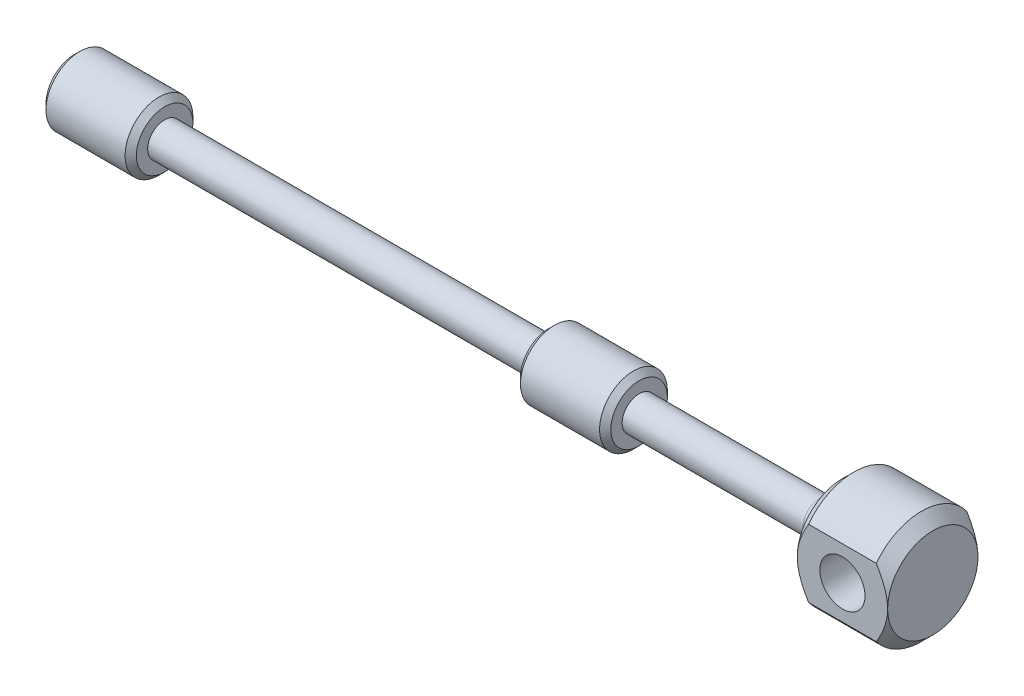
ISO-10303-21;
HEADER;
FILE_DESCRIPTION(('STEP AP214'),'2;1');
FILE_NAME('part.step','',(''),(''),'','','');
FILE_SCHEMA(('AUTOMOTIVE_DESIGN { 1 0 10303 214 1 1 1 1 }'));
ENDSEC;
DATA;
#1=APPLICATION_CONTEXT('core data for automotive mechanical design processes');
#2=APPLICATION_PROTOCOL_DEFINITION('international standard','automotive_design',2000,#1);
#3=PRODUCT_CONTEXT('',#1,'mechanical');
#4=PRODUCT('Part','Part','',(#3));
#5=PRODUCT_RELATED_PRODUCT_CATEGORY('part','',(#4));
#6=PRODUCT_DEFINITION_FORMATION('','',#4);
#7=PRODUCT_DEFINITION_CONTEXT('part definition',#1,'design');
#8=PRODUCT_DEFINITION('design','',#6,#7);
#9=PRODUCT_DEFINITION_SHAPE('','',#8);
#10=(LENGTH_UNIT() NAMED_UNIT(*) SI_UNIT(.MILLI.,.METRE.));
#11=(NAMED_UNIT(*) PLANE_ANGLE_UNIT() SI_UNIT($,.RADIAN.));
#12=(NAMED_UNIT(*) SI_UNIT($,.STERADIAN.) SOLID_ANGLE_UNIT());
#13=UNCERTAINTY_MEASURE_WITH_UNIT(LENGTH_MEASURE(1.E-05),#10,'distance_accuracy_value','');
#14=(GEOMETRIC_REPRESENTATION_CONTEXT(3) GLOBAL_UNCERTAINTY_ASSIGNED_CONTEXT((#13)) GLOBAL_UNIT_ASSIGNED_CONTEXT((#10,
#11,#12)) REPRESENTATION_CONTEXT('',''));
#15=CARTESIAN_POINT('',(0.,0.,0.));
#16=DIRECTION('',(0.,0.,1.));
#17=DIRECTION('',(1.,0.,0.));
#18=AXIS2_PLACEMENT_3D('',#15,#16,#17);
#19=CARTESIAN_POINT('',(30.,0.,0.));
#20=DIRECTION('',(1.,0.,0.));
#21=DIRECTION('',(0.,0.,-1.));
#22=AXIS2_PLACEMENT_3D('',#19,#20,#21);
#23=CYLINDRICAL_SURFACE('',#22,5.);
#24=DIRECTION('',(1.,0.,0.));
#25=VECTOR('',#24,1.);
#26=CARTESIAN_POINT('',(30.,3.,-4.));
#27=LINE('',#26,#25);
#28=CARTESIAN_POINT('',(31.,3.,-4.));
#29=VERTEX_POINT('',#28);
#30=CARTESIAN_POINT('',(37.,3.,-4.));
#31=VERTEX_POINT('',#30);
#32=EDGE_CURVE('E352',#29,#31,#27,.T.);
#33=ORIENTED_EDGE('',*,*,#32,.F.);
#34=CARTESIAN_POINT('',(31.,0.,0.));
#35=DIRECTION('',(1.,0.,0.));
#36=DIRECTION('',(0.,0.,-1.));
#37=AXIS2_PLACEMENT_3D('',#34,#35,#36);
#38=CIRCLE('',#37,5.);
#39=CARTESIAN_POINT('',(31.,3.,4.));
#40=VERTEX_POINT('',#39);
#41=EDGE_CURVE('E200',#29,#40,#38,.T.);
#42=ORIENTED_EDGE('',*,*,#41,.T.);
#43=DIRECTION('',(1.,0.,0.));
#44=VECTOR('',#43,1.);
#45=CARTESIAN_POINT('',(30.,3.,4.));
#46=LINE('',#45,#44);
#47=CARTESIAN_POINT('',(37.,3.,4.));
#48=VERTEX_POINT('',#47);
#49=EDGE_CURVE('E115',#40,#48,#46,.T.);
#50=ORIENTED_EDGE('',*,*,#49,.T.);
#51=CARTESIAN_POINT('',(37.,0.,0.));
#52=DIRECTION('',(1.,0.,0.));
#53=DIRECTION('',(0.,0.,-1.));
#54=AXIS2_PLACEMENT_3D('',#51,#52,#53);
#55=CIRCLE('',#54,5.);
#56=EDGE_CURVE('E104',#48,#31,#55,.F.);
#57=ORIENTED_EDGE('',*,*,#56,.T.);
#58=EDGE_LOOP('',(#33,#42,#50,#57));
#59=FACE_BOUND('',#58,.T.);
#60=ADVANCED_FACE('F39',(#59),#23,.T.);
#61=CARTESIAN_POINT('',(38.,0.,0.));
#62=DIRECTION('',(-1.,0.,0.));
#63=DIRECTION('',(0.,0.,1.));
#64=AXIS2_PLACEMENT_3D('',#61,#62,#63);
#65=CYLINDRICAL_SURFACE('',#64,1.5);
#66=CARTESIAN_POINT('',(28.,0.,0.));
#67=DIRECTION('',(1.,0.,0.));
#68=DIRECTION('',(0.,0.,-1.));
#69=AXIS2_PLACEMENT_3D('',#66,#67,#68);
#70=CIRCLE('',#69,1.5);
#71=CARTESIAN_POINT('',(28.,0.,-1.5));
#72=VERTEX_POINT('',#71);
#73=EDGE_CURVE('E11',#72,#72,#70,.F.);
#74=ORIENTED_EDGE('',*,*,#73,.T.);
#75=EDGE_LOOP('',(#74));
#76=FACE_BOUND('',#75,.T.);
#77=CARTESIAN_POINT('',(12.,0.,0.));
#78=DIRECTION('',(-1.,0.,0.));
#79=DIRECTION('',(0.,0.,1.));
#80=AXIS2_PLACEMENT_3D('',#77,#78,#79);
#81=CIRCLE('',#80,1.5);
#82=CARTESIAN_POINT('',(12.,0.,1.5));
#83=VERTEX_POINT('',#82);
#84=EDGE_CURVE('E300',#83,#83,#81,.T.);
#85=ORIENTED_EDGE('',*,*,#84,.F.);
#86=EDGE_LOOP('',(#85));
#87=FACE_BOUND('',#86,.T.);
#88=ADVANCED_FACE('F224',(#76,#87),#65,.T.);
#89=CARTESIAN_POINT('',(4.,0.,0.));
#90=DIRECTION('',(-1.,0.,0.));
#91=DIRECTION('',(0.,0.,1.));
#92=AXIS2_PLACEMENT_3D('',#89,#90,#91);
#93=CIRCLE('',#92,1.5);
#94=CARTESIAN_POINT('',(4.,0.,1.5));
#95=VERTEX_POINT('',#94);
#96=EDGE_CURVE('E293',#95,#95,#93,.T.);
#97=ORIENTED_EDGE('',*,*,#96,.T.);
#98=EDGE_LOOP('',(#97));
#99=FACE_BOUND('',#98,.T.);
#100=CARTESIAN_POINT('',(-30.,0.,0.));
#101=DIRECTION('',(-1.,0.,0.));
#102=DIRECTION('',(0.,0.,1.));
#103=AXIS2_PLACEMENT_3D('',#100,#101,#102);
#104=CIRCLE('',#103,1.5);
#105=CARTESIAN_POINT('',(-30.,0.,1.5));
#106=VERTEX_POINT('',#105);
#107=EDGE_CURVE('E295',#106,#106,#104,.T.);
#108=ORIENTED_EDGE('',*,*,#107,.F.);
#109=EDGE_LOOP('',(#108));
#110=FACE_BOUND('',#109,.T.);
#111=ADVANCED_FACE('F229',(#99,#110),#65,.T.);
#112=CARTESIAN_POINT('',(-30.,0.,0.));
#113=DIRECTION('',(-1.,0.,0.));
#114=DIRECTION('',(0.,0.,1.));
#115=AXIS2_PLACEMENT_3D('',#112,#113,#114);
#116=CYLINDRICAL_SURFACE('',#115,3.);
#117=CARTESIAN_POINT('',(-37.5,0.,0.));
#118=DIRECTION('',(1.,0.,0.));
#119=DIRECTION('',(0.,0.,-1.));
#120=AXIS2_PLACEMENT_3D('',#117,#118,#119);
#121=CIRCLE('',#120,3.);
#122=CARTESIAN_POINT('',(-37.5,0.,-3.));
#123=VERTEX_POINT('',#122);
#124=EDGE_CURVE('E327',#123,#123,#121,.T.);
#125=ORIENTED_EDGE('',*,*,#124,.T.);
#126=EDGE_LOOP('',(#125));
#127=FACE_BOUND('',#126,.T.);
#128=CARTESIAN_POINT('',(-30.5,0.,0.));
#129=DIRECTION('',(-1.,0.,0.));
#130=DIRECTION('',(0.,0.,1.));
#131=AXIS2_PLACEMENT_3D('',#128,#129,#130);
#132=CIRCLE('',#131,3.);
#133=CARTESIAN_POINT('',(-30.5,0.,3.));
#134=VERTEX_POINT('',#133);
#135=EDGE_CURVE('E323',#134,#134,#132,.T.);
#136=ORIENTED_EDGE('',*,*,#135,.T.);
#137=EDGE_LOOP('',(#136));
#138=FACE_BOUND('',#137,.T.);
#139=ADVANCED_FACE('F260',(#127,#138),#116,.T.);
#140=CARTESIAN_POINT('',(-30.,0.,0.));
#141=DIRECTION('',(-1.,0.,0.));
#142=DIRECTION('',(0.,0.,1.));
#143=AXIS2_PLACEMENT_3D('',#140,#141,#142);
#144=PLANE('',#143);
#145=CARTESIAN_POINT('',(-30.,0.,0.));
#146=DIRECTION('',(-1.,0.,0.));
#147=DIRECTION('',(0.,0.,1.));
#148=AXIS2_PLACEMENT_3D('',#145,#146,#147);
#149=CIRCLE('',#148,2.5);
#150=CARTESIAN_POINT('',(-30.,0.,2.5));
#151=VERTEX_POINT('',#150);
#152=EDGE_CURVE('E128',#151,#151,#149,.F.);
#153=ORIENTED_EDGE('',*,*,#152,.T.);
#154=EDGE_LOOP('',(#153));
#155=FACE_BOUND('',#154,.T.);
#156=ORIENTED_EDGE('',*,*,#107,.T.);
#157=EDGE_LOOP('',(#156));
#158=FACE_BOUND('',#157,.T.);
#159=ADVANCED_FACE('F266',(#155,#158),#144,.F.);
#160=CARTESIAN_POINT('',(-38.,0.,0.));
#161=DIRECTION('',(1.,0.,0.));
#162=DIRECTION('',(0.,0.,-1.));
#163=AXIS2_PLACEMENT_3D('',#160,#161,#162);
#164=PLANE('',#163);
#165=CARTESIAN_POINT('',(-38.,0.,0.));
#166=DIRECTION('',(1.,0.,0.));
#167=DIRECTION('',(0.,0.,-1.));
#168=AXIS2_PLACEMENT_3D('',#165,#166,#167);
#169=CIRCLE('',#168,2.5);
#170=CARTESIAN_POINT('',(-38.,0.,-2.5));
#171=VERTEX_POINT('',#170);
#172=EDGE_CURVE('E319',#171,#171,#169,.F.);
#173=ORIENTED_EDGE('',*,*,#172,.T.);
#174=EDGE_LOOP('',(#173));
#175=FACE_BOUND('',#174,.T.);
#176=ADVANCED_FACE('F262',(#175),#164,.F.);
#177=CARTESIAN_POINT('',(4.,0.,0.));
#178=DIRECTION('',(1.,0.,0.));
#179=DIRECTION('',(0.,0.,-1.));
#180=AXIS2_PLACEMENT_3D('',#177,#178,#179);
#181=CYLINDRICAL_SURFACE('',#180,3.);
#182=CARTESIAN_POINT('',(11.5,0.,0.));
#183=DIRECTION('',(-1.,0.,0.));
#184=DIRECTION('',(0.,0.,1.));
#185=AXIS2_PLACEMENT_3D('',#182,#183,#184);
#186=CIRCLE('',#185,3.);
#187=CARTESIAN_POINT('',(11.5,0.,3.));
#188=VERTEX_POINT('',#187);
#189=EDGE_CURVE('E309',#188,#188,#186,.T.);
#190=ORIENTED_EDGE('',*,*,#189,.T.);
#191=EDGE_LOOP('',(#190));
#192=FACE_BOUND('',#191,.T.);
#193=CARTESIAN_POINT('',(4.50000000000001,0.,0.));
#194=DIRECTION('',(-1.,0.,0.));
#195=DIRECTION('',(0.,0.,1.));
#196=AXIS2_PLACEMENT_3D('',#193,#194,#195);
#197=CIRCLE('',#196,3.);
#198=CARTESIAN_POINT('',(4.50000000000001,0.,3.));
#199=VERTEX_POINT('',#198);
#200=EDGE_CURVE('E305',#199,#199,#197,.F.);
#201=ORIENTED_EDGE('',*,*,#200,.T.);
#202=EDGE_LOOP('',(#201));
#203=FACE_BOUND('',#202,.T.);
#204=ADVANCED_FACE('F265',(#192,#203),#181,.T.);
#205=CARTESIAN_POINT('',(4.,0.,0.));
#206=DIRECTION('',(-1.,0.,0.));
#207=DIRECTION('',(0.,0.,1.));
#208=AXIS2_PLACEMENT_3D('',#205,#206,#207);
#209=PLANE('',#208);
#210=CARTESIAN_POINT('',(4.,0.,0.));
#211=DIRECTION('',(-1.,0.,0.));
#212=DIRECTION('',(0.,0.,1.));
#213=AXIS2_PLACEMENT_3D('',#210,#211,#212);
#214=CIRCLE('',#213,2.5);
#215=CARTESIAN_POINT('',(4.,0.,2.5));
#216=VERTEX_POINT('',#215);
#217=EDGE_CURVE('E290',#216,#216,#214,.T.);
#218=ORIENTED_EDGE('',*,*,#217,.T.);
#219=EDGE_LOOP('',(#218));
#220=FACE_BOUND('',#219,.T.);
#221=ORIENTED_EDGE('',*,*,#96,.F.);
#222=EDGE_LOOP('',(#221));
#223=FACE_BOUND('',#222,.T.);
#224=ADVANCED_FACE('F279',(#220,#223),#209,.T.);
#225=CARTESIAN_POINT('',(12.,0.,0.));
#226=DIRECTION('',(-1.,0.,0.));
#227=DIRECTION('',(0.,0.,1.));
#228=AXIS2_PLACEMENT_3D('',#225,#226,#227);
#229=PLANE('',#228);
#230=CARTESIAN_POINT('',(12.,0.,0.));
#231=DIRECTION('',(-1.,0.,0.));
#232=DIRECTION('',(0.,0.,1.));
#233=AXIS2_PLACEMENT_3D('',#230,#231,#232);
#234=CIRCLE('',#233,2.50000000000001);
#235=CARTESIAN_POINT('',(12.,0.,2.50000000000001));
#236=VERTEX_POINT('',#235);
#237=EDGE_CURVE('E313',#236,#236,#234,.F.);
#238=ORIENTED_EDGE('',*,*,#237,.T.);
#239=EDGE_LOOP('',(#238));
#240=FACE_BOUND('',#239,.T.);
#241=ORIENTED_EDGE('',*,*,#84,.T.);
#242=EDGE_LOOP('',(#241));
#243=FACE_BOUND('',#242,.T.);
#244=ADVANCED_FACE('F256',(#240,#243),#229,.F.);
#245=CARTESIAN_POINT('',(11.5,0.,0.));
#246=DIRECTION('',(-1.,0.,0.));
#247=DIRECTION('',(0.,0.,1.));
#248=AXIS2_PLACEMENT_3D('',#245,#246,#247);
#249=CONICAL_SURFACE('',#248,3.,0.785398163397453);
#250=ORIENTED_EDGE('',*,*,#237,.F.);
#251=EDGE_LOOP('',(#250));
#252=FACE_BOUND('',#251,.T.);
#253=ORIENTED_EDGE('',*,*,#189,.F.);
#254=EDGE_LOOP('',(#253));
#255=FACE_BOUND('',#254,.T.);
#256=ADVANCED_FACE('F253',(#252,#255),#249,.T.);
#257=CARTESIAN_POINT('',(4.,0.,0.));
#258=DIRECTION('',(1.,0.,0.));
#259=DIRECTION('',(0.,0.,-1.));
#260=AXIS2_PLACEMENT_3D('',#257,#258,#259);
#261=CONICAL_SURFACE('',#260,2.5,0.785398163397444);
#262=ORIENTED_EDGE('',*,*,#200,.F.);
#263=EDGE_LOOP('',(#262));
#264=FACE_BOUND('',#263,.T.);
#265=ORIENTED_EDGE('',*,*,#217,.F.);
#266=EDGE_LOOP('',(#265));
#267=FACE_BOUND('',#266,.T.);
#268=ADVANCED_FACE('F245',(#264,#267),#261,.T.);
#269=CARTESIAN_POINT('',(-38.,0.,0.));
#270=DIRECTION('',(1.,0.,0.));
#271=DIRECTION('',(0.,0.,-1.));
#272=AXIS2_PLACEMENT_3D('',#269,#270,#271);
#273=CONICAL_SURFACE('',#272,2.5,0.785398163397446);
#274=ORIENTED_EDGE('',*,*,#124,.F.);
#275=EDGE_LOOP('',(#274));
#276=FACE_BOUND('',#275,.T.);
#277=ORIENTED_EDGE('',*,*,#172,.F.);
#278=EDGE_LOOP('',(#277));
#279=FACE_BOUND('',#278,.T.);
#280=ADVANCED_FACE('F240',(#276,#279),#273,.T.);
#281=CARTESIAN_POINT('',(-30.5,0.,0.));
#282=DIRECTION('',(-1.,0.,0.));
#283=DIRECTION('',(0.,0.,1.));
#284=AXIS2_PLACEMENT_3D('',#281,#282,#283);
#285=CONICAL_SURFACE('',#284,3.,0.785398163397453);
#286=ORIENTED_EDGE('',*,*,#152,.F.);
#287=EDGE_LOOP('',(#286));
#288=FACE_BOUND('',#287,.T.);
#289=ORIENTED_EDGE('',*,*,#135,.F.);
#290=EDGE_LOOP('',(#289));
#291=FACE_BOUND('',#290,.T.);
#292=ADVANCED_FACE('F235',(#288,#291),#285,.T.);
#293=DIRECTION('',(1.,0.,0.));
#294=VECTOR('',#293,1.);
#295=CARTESIAN_POINT('',(30.,-3.,4.));
#296=LINE('',#295,#294);
#297=CARTESIAN_POINT('',(31.,-3.,4.));
#298=VERTEX_POINT('',#297);
#299=CARTESIAN_POINT('',(37.,-3.,4.));
#300=VERTEX_POINT('',#299);
#301=EDGE_CURVE('E97',#298,#300,#296,.T.);
#302=ORIENTED_EDGE('',*,*,#301,.F.);
#303=CARTESIAN_POINT('',(31.,0.,0.));
#304=DIRECTION('',(1.,0.,0.));
#305=DIRECTION('',(0.,0.,-1.));
#306=AXIS2_PLACEMENT_3D('',#303,#304,#305);
#307=CIRCLE('',#306,5.);
#308=CARTESIAN_POINT('',(31.,-3.,-4.));
#309=VERTEX_POINT('',#308);
#310=EDGE_CURVE('E110',#298,#309,#307,.T.);
#311=ORIENTED_EDGE('',*,*,#310,.T.);
#312=DIRECTION('',(1.,0.,0.));
#313=VECTOR('',#312,1.);
#314=CARTESIAN_POINT('',(30.,-3.,-4.));
#315=LINE('',#314,#313);
#316=CARTESIAN_POINT('',(37.,-3.,-4.));
#317=VERTEX_POINT('',#316);
#318=EDGE_CURVE('E116',#309,#317,#315,.T.);
#319=ORIENTED_EDGE('',*,*,#318,.T.);
#320=CARTESIAN_POINT('',(37.,0.,0.));
#321=DIRECTION('',(1.,0.,0.));
#322=DIRECTION('',(0.,0.,-1.));
#323=AXIS2_PLACEMENT_3D('',#320,#321,#322);
#324=CIRCLE('',#323,5.);
#325=EDGE_CURVE('E113',#317,#300,#324,.F.);
#326=ORIENTED_EDGE('',*,*,#325,.T.);
#327=EDGE_LOOP('',(#302,#311,#319,#326));
#328=FACE_BOUND('',#327,.T.);
#329=ADVANCED_FACE('F108',(#328),#23,.T.);
#330=CARTESIAN_POINT('',(30.,0.,0.));
#331=DIRECTION('',(1.,0.,0.));
#332=DIRECTION('',(0.,0.,-1.));
#333=AXIS2_PLACEMENT_3D('',#330,#331,#332);
#334=PLANE('',#333);
#335=CARTESIAN_POINT('',(30.,0.,0.));
#336=DIRECTION('',(1.,0.,0.));
#337=DIRECTION('',(0.,0.,-1.));
#338=AXIS2_PLACEMENT_3D('',#335,#336,#337);
#339=CIRCLE('',#338,3.5);
#340=CARTESIAN_POINT('',(30.,0.,-3.5));
#341=VERTEX_POINT('',#340);
#342=EDGE_CURVE('E48',#341,#341,#339,.T.);
#343=ORIENTED_EDGE('',*,*,#342,.T.);
#344=EDGE_LOOP('',(#343));
#345=FACE_BOUND('',#344,.T.);
#346=CARTESIAN_POINT('',(30.,0.,0.));
#347=DIRECTION('',(1.,0.,0.));
#348=DIRECTION('',(0.,0.,-1.));
#349=AXIS2_PLACEMENT_3D('',#346,#347,#348);
#350=CIRCLE('',#349,4.);
#351=CARTESIAN_POINT('',(30.,0.,4.));
#352=VERTEX_POINT('',#351);
#353=CARTESIAN_POINT('',(30.,0.,-4.));
#354=VERTEX_POINT('',#353);
#355=EDGE_CURVE('E524',#352,#354,#350,.F.);
#356=ORIENTED_EDGE('',*,*,#355,.T.);
#357=CARTESIAN_POINT('',(30.,0.,0.));
#358=DIRECTION('',(1.,0.,0.));
#359=DIRECTION('',(0.,0.,-1.));
#360=AXIS2_PLACEMENT_3D('',#357,#358,#359);
#361=CIRCLE('',#360,4.);
#362=EDGE_CURVE('E526',#354,#352,#361,.F.);
#363=ORIENTED_EDGE('',*,*,#362,.T.);
#364=EDGE_LOOP('',(#356,#363));
#365=FACE_BOUND('',#364,.T.);
#366=ADVANCED_FACE('F154',(#345,#365),#334,.F.);
#367=CARTESIAN_POINT('',(38.,0.,0.));
#368=DIRECTION('',(1.,0.,0.));
#369=DIRECTION('',(0.,0.,-1.));
#370=AXIS2_PLACEMENT_3D('',#367,#368,#369);
#371=PLANE('',#370);
#372=CARTESIAN_POINT('',(38.,0.,0.));
#373=DIRECTION('',(1.,0.,0.));
#374=DIRECTION('',(0.,0.,-1.));
#375=AXIS2_PLACEMENT_3D('',#372,#373,#374);
#376=CIRCLE('',#375,4.);
#377=CARTESIAN_POINT('',(38.,0.,4.));
#378=VERTEX_POINT('',#377);
#379=CARTESIAN_POINT('',(38.,0.,-4.));
#380=VERTEX_POINT('',#379);
#381=EDGE_CURVE('E203',#378,#380,#376,.T.);
#382=ORIENTED_EDGE('',*,*,#381,.T.);
#383=CARTESIAN_POINT('',(38.,0.,0.));
#384=DIRECTION('',(1.,0.,0.));
#385=DIRECTION('',(0.,0.,-1.));
#386=AXIS2_PLACEMENT_3D('',#383,#384,#385);
#387=CIRCLE('',#386,4.);
#388=EDGE_CURVE('E207',#380,#378,#387,.T.);
#389=ORIENTED_EDGE('',*,*,#388,.T.);
#390=EDGE_LOOP('',(#382,#389));
#391=FACE_BOUND('',#390,.T.);
#392=ADVANCED_FACE('F150',(#391),#371,.T.);
#393=CARTESIAN_POINT('',(30.,3.,-4.));
#394=DIRECTION('',(0.,0.,1.));
#395=DIRECTION('',(1.,0.,0.));
#396=AXIS2_PLACEMENT_3D('',#393,#394,#395);
#397=PLANE('',#396);
#398=CARTESIAN_POINT('',(34.,0.,-4.));
#399=DIRECTION('',(0.,0.,1.));
#400=DIRECTION('',(1.,0.,0.));
#401=AXIS2_PLACEMENT_3D('',#398,#399,#400);
#402=CIRCLE('',#401,2.);
#403=CARTESIAN_POINT('',(36.,0.,-4.));
#404=VERTEX_POINT('',#403);
#405=EDGE_CURVE('E356',#404,#404,#402,.T.);
#406=ORIENTED_EDGE('',*,*,#405,.T.);
#407=EDGE_LOOP('',(#406));
#408=FACE_BOUND('',#407,.T.);
#409=ORIENTED_EDGE('',*,*,#318,.F.);
#410=CARTESIAN_POINT('',(31.,-3.,-4.));
#411=CARTESIAN_POINT('',(30.9565814055769,-2.92762836200348,-4.));
#412=CARTESIAN_POINT('',(30.9138959485449,-2.85481802742838,-4.));
#413=CARTESIAN_POINT('',(30.83019894129,-2.70821938275152,-4.));
#414=CARTESIAN_POINT('',(30.7891877950873,-2.63443084222755,-4.));
#415=CARTESIAN_POINT('',(30.6687412261486,-2.41100406792378,-4.));
#416=CARTESIAN_POINT('',(30.5921850767644,-2.25978602411566,-4.));
#417=CARTESIAN_POINT('',(30.450923903765,-1.95659067359724,-4.));
#418=CARTESIAN_POINT('',(30.3859648909347,-1.80473273623761,-4.));
#419=CARTESIAN_POINT('',(30.2683839947351,-1.49644202508,-4.));
#420=CARTESIAN_POINT('',(30.2157450905884,-1.34001590275355,-4.));
#421=CARTESIAN_POINT('',(30.1438275437783,-1.08612110951736,-4.));
#422=CARTESIAN_POINT('',(30.1196197271478,-0.9900423026256,-4.));
#423=CARTESIAN_POINT('',(30.0774412059882,-0.796520862813746,-4.));
#424=CARTESIAN_POINT('',(30.0594697158391,-0.699078403289634,-4.));
#425=CARTESIAN_POINT('',(30.0301457323276,-0.501704347689387,-4.));
#426=CARTESIAN_POINT('',(30.0188959865408,-0.401757304518318,-4.));
#427=CARTESIAN_POINT('',(30.0037953128905,-0.201215242114617,-4.));
#428=CARTESIAN_POINT('',(29.999951356772,-0.100619701668961,-4.));
#429=CARTESIAN_POINT('',(30.,0.,-4.));
#430=B_SPLINE_CURVE_WITH_KNOTS('',3,(#410,#411,#412,#413,#414,#415,#416,#417,#418,#419,#420,
#421,#422,#423,#424,#425,#426,#427,#428,#429),.UNSPECIFIED.,.F.,.F.,(4,2,2,2,2,2,2,2,2,4),(0.,
0.253181371589521,0.50642348038386,1.01459556294124,1.50970891621843,2.00413415664271,
2.30120350256043,2.59823541162861,2.89969868702638,3.20144561888665),.UNSPECIFIED.);
#431=EDGE_CURVE('E120',#309,#354,#430,.T.);
#432=ORIENTED_EDGE('',*,*,#431,.T.);
#433=CARTESIAN_POINT('',(30.,0.,-4.));
#434=CARTESIAN_POINT('',(29.999995048581,0.061489682171243,-4.));
#435=CARTESIAN_POINT('',(30.0014185758096,0.122970237034907,-4.));
#436=CARTESIAN_POINT('',(30.0070760257621,0.245792268954904,-4.));
#437=CARTESIAN_POINT('',(30.0113094947052,0.30713376686301,-4.));
#438=CARTESIAN_POINT('',(30.0281318667511,0.490538519574098,-4.));
#439=CARTESIAN_POINT('',(30.0448431319862,0.612243847557199,-4.));
#440=CARTESIAN_POINT('',(30.0880127467618,0.85177384988457,-4.));
#441=CARTESIAN_POINT('',(30.1143041589317,0.969629397394435,-4.));
#442=CARTESIAN_POINT('',(30.175496666789,1.20311028898422,-4.));
#443=CARTESIAN_POINT('',(30.210401313596,1.31873469194054,-4.));
#444=CARTESIAN_POINT('',(30.2948602113957,1.56915278958547,-4.));
#445=CARTESIAN_POINT('',(30.3459370048148,1.70342909226878,-4.));
#446=CARTESIAN_POINT('',(30.4565094208477,1.96849997837182,-4.));
#447=CARTESIAN_POINT('',(30.516009141589,2.09929282991422,-4.));
#448=CARTESIAN_POINT('',(30.6430430444663,2.36033095148102,-4.));
#449=CARTESIAN_POINT('',(30.7107211665127,2.49050544053603,-4.));
#450=CARTESIAN_POINT('',(30.8515677946968,2.74756392847845,-4.));
#451=CARTESIAN_POINT('',(30.9247264560827,2.87445330157051,-4.));
#452=CARTESIAN_POINT('',(31.,3.,-4.));
#453=B_SPLINE_CURVE_WITH_KNOTS('',3,(#433,#434,#435,#436,#437,#438,#439,#440,#441,#442,#443,
#444,#445,#446,#447,#448,#449,#450,#451,#452),.UNSPECIFIED.,.F.,.F.,(4,2,2,2,2,2,2,2,2,4),(0.,
0.184435127504878,0.368840477618777,0.736868694951203,1.09876868246572,1.46081812644691,
1.89144466887991,2.32228145495383,2.76227942763344,3.20150515183776),.UNSPECIFIED.);
#454=EDGE_CURVE('E160',#354,#29,#453,.T.);
#455=ORIENTED_EDGE('',*,*,#454,.T.);
#456=ORIENTED_EDGE('',*,*,#32,.T.);
#457=CARTESIAN_POINT('',(37.,3.,-4.));
#458=CARTESIAN_POINT('',(37.043418594423,2.92762836200348,-4.));
#459=CARTESIAN_POINT('',(37.0861040514551,2.85481802742838,-4.));
#460=CARTESIAN_POINT('',(37.16980105871,2.70821938275152,-4.));
#461=CARTESIAN_POINT('',(37.2108122049126,2.63443084222755,-4.));
#462=CARTESIAN_POINT('',(37.3312587738514,2.41100406792379,-4.));
#463=CARTESIAN_POINT('',(37.4078149232356,2.25978602411566,-4.));
#464=CARTESIAN_POINT('',(37.549076096235,1.95659067359726,-4.));
#465=CARTESIAN_POINT('',(37.6140351090652,1.80473273623763,-4.));
#466=CARTESIAN_POINT('',(37.7316160052649,1.49644202508002,-4.));
#467=CARTESIAN_POINT('',(37.7842549094116,1.34001590275357,-4.));
#468=CARTESIAN_POINT('',(37.8561724562217,1.08612110951738,-4.));
#469=CARTESIAN_POINT('',(37.8803802728522,0.990042302625621,-4.));
#470=CARTESIAN_POINT('',(37.9225587940118,0.796520862813763,-4.));
#471=CARTESIAN_POINT('',(37.9405302841609,0.69907840328965,-4.));
#472=CARTESIAN_POINT('',(37.9698542676724,0.501704347689399,-4.));
#473=CARTESIAN_POINT('',(37.9811040134592,0.401757304518328,-4.));
#474=CARTESIAN_POINT('',(37.9962046871095,0.201215242114622,-4.));
#475=CARTESIAN_POINT('',(38.000048643228,0.100619701668964,-4.));
#476=CARTESIAN_POINT('',(38.,0.,-4.));
#477=B_SPLINE_CURVE_WITH_KNOTS('',3,(#457,#458,#459,#460,#461,#462,#463,#464,#465,#466,#467,
#468,#469,#470,#471,#472,#473,#474,#475,#476),.UNSPECIFIED.,.F.,.F.,(4,2,2,2,2,2,2,2,2,4),(0.,
0.253181371589518,0.506423480383855,1.01459556294123,1.50970891621841,2.00413415664269,
2.30120350256042,2.5982354116286,2.89969868702638,3.20144561888665),.UNSPECIFIED.);
#478=EDGE_CURVE('E126',#31,#380,#477,.T.);
#479=ORIENTED_EDGE('',*,*,#478,.T.);
#480=CARTESIAN_POINT('',(38.,0.,-4.));
#481=CARTESIAN_POINT('',(38.000004951419,-0.0614896821712422,-4.));
#482=CARTESIAN_POINT('',(37.9985814241904,-0.122970237034905,-4.));
#483=CARTESIAN_POINT('',(37.9929239742379,-0.245792268954901,-4.));
#484=CARTESIAN_POINT('',(37.9886905052948,-0.307133766863006,-4.));
#485=CARTESIAN_POINT('',(37.9718681332489,-0.490538519574092,-4.));
#486=CARTESIAN_POINT('',(37.9551568680138,-0.612243847557191,-4.));
#487=CARTESIAN_POINT('',(37.9119872532383,-0.851773849884559,-4.));
#488=CARTESIAN_POINT('',(37.8856958410683,-0.969629397394424,-4.));
#489=CARTESIAN_POINT('',(37.824503333211,-1.20311028898421,-4.));
#490=CARTESIAN_POINT('',(37.789598686404,-1.31873469194052,-4.));
#491=CARTESIAN_POINT('',(37.7051397886043,-1.56915278958546,-4.));
#492=CARTESIAN_POINT('',(37.6540629951852,-1.70342909226876,-4.));
#493=CARTESIAN_POINT('',(37.5434905791523,-1.96849997837181,-4.));
#494=CARTESIAN_POINT('',(37.483990858411,-2.09929282991421,-4.));
#495=CARTESIAN_POINT('',(37.3569569555337,-2.36033095148102,-4.));
#496=CARTESIAN_POINT('',(37.2892788334873,-2.49050544053602,-4.));
#497=CARTESIAN_POINT('',(37.1484322053032,-2.74756392847844,-4.));
#498=CARTESIAN_POINT('',(37.0752735439173,-2.87445330157051,-4.));
#499=CARTESIAN_POINT('',(37.,-3.,-4.));
#500=B_SPLINE_CURVE_WITH_KNOTS('',3,(#480,#481,#482,#483,#484,#485,#486,#487,#488,#489,#490,
#491,#492,#493,#494,#495,#496,#497,#498,#499),.UNSPECIFIED.,.F.,.F.,(4,2,2,2,2,2,2,2,2,4),(0.,
0.184435127504876,0.368840477618772,0.736868694951194,1.0987686824657,1.46081812644689,
1.8914446688799,2.32228145495382,2.76227942763343,3.20150515183777),.UNSPECIFIED.);
#501=EDGE_CURVE('E122',#380,#317,#500,.T.);
#502=ORIENTED_EDGE('',*,*,#501,.T.);
#503=EDGE_LOOP('',(#409,#432,#455,#456,#479,#502));
#504=FACE_BOUND('',#503,.T.);
#505=ADVANCED_FACE('F145',(#408,#504),#397,.F.);
#506=CARTESIAN_POINT('',(30.,3.,4.));
#507=DIRECTION('',(0.,0.,-1.));
#508=DIRECTION('',(-1.,0.,0.));
#509=AXIS2_PLACEMENT_3D('',#506,#507,#508);
#510=PLANE('',#509);
#511=CARTESIAN_POINT('',(34.,0.,4.));
#512=DIRECTION('',(0.,0.,1.));
#513=DIRECTION('',(1.,0.,0.));
#514=AXIS2_PLACEMENT_3D('',#511,#512,#513);
#515=CIRCLE('',#514,2.);
#516=CARTESIAN_POINT('',(36.,0.,4.));
#517=VERTEX_POINT('',#516);
#518=EDGE_CURVE('E359',#517,#517,#515,.T.);
#519=ORIENTED_EDGE('',*,*,#518,.F.);
#520=EDGE_LOOP('',(#519));
#521=FACE_BOUND('',#520,.T.);
#522=CARTESIAN_POINT('',(31.,3.,4.));
#523=CARTESIAN_POINT('',(30.9565814055769,2.92762836200348,4.));
#524=CARTESIAN_POINT('',(30.9138959485449,2.85481802742838,4.));
#525=CARTESIAN_POINT('',(30.83019894129,2.70821938275151,4.));
#526=CARTESIAN_POINT('',(30.7891877950873,2.63443084222755,4.));
#527=CARTESIAN_POINT('',(30.6687412261486,2.41100406792378,4.));
#528=CARTESIAN_POINT('',(30.5921850767644,2.25978602411566,4.));
#529=CARTESIAN_POINT('',(30.450923903765,1.95659067359724,4.));
#530=CARTESIAN_POINT('',(30.3859648909348,1.80473273623761,4.));
#531=CARTESIAN_POINT('',(30.2683839947351,1.49644202508,4.));
#532=CARTESIAN_POINT('',(30.2157450905884,1.34001590275355,4.));
#533=CARTESIAN_POINT('',(30.1438275437783,1.08612110951736,4.));
#534=CARTESIAN_POINT('',(30.1196197271478,0.9900423026256,4.));
#535=CARTESIAN_POINT('',(30.0774412059882,0.796520862813747,4.));
#536=CARTESIAN_POINT('',(30.0594697158391,0.699078403289634,4.));
#537=CARTESIAN_POINT('',(30.0301457323276,0.501704347689387,4.));
#538=CARTESIAN_POINT('',(30.0188959865408,0.401757304518318,4.));
#539=CARTESIAN_POINT('',(30.0037953128905,0.201215242114616,4.));
#540=CARTESIAN_POINT('',(29.999951356772,0.10061970166896,4.));
#541=CARTESIAN_POINT('',(30.,0.,4.));
#542=B_SPLINE_CURVE_WITH_KNOTS('',3,(#522,#523,#524,#525,#526,#527,#528,#529,#530,#531,#532,
#533,#534,#535,#536,#537,#538,#539,#540,#541),.UNSPECIFIED.,.F.,.F.,(4,2,2,2,2,2,2,2,2,4),(0.,
0.253181371589521,0.50642348038386,1.01459556294124,1.50970891621843,2.00413415664271,
2.30120350256043,2.59823541162861,2.89969868702638,3.20144561888665),.UNSPECIFIED.);
#543=EDGE_CURVE('E63',#40,#352,#542,.T.);
#544=ORIENTED_EDGE('',*,*,#543,.T.);
#545=CARTESIAN_POINT('',(30.,0.,4.));
#546=CARTESIAN_POINT('',(29.999995048581,-0.061489682171243,4.));
#547=CARTESIAN_POINT('',(30.0014185758096,-0.122970237034907,4.));
#548=CARTESIAN_POINT('',(30.0070760257621,-0.245792268954904,4.));
#549=CARTESIAN_POINT('',(30.0113094947052,-0.30713376686301,4.));
#550=CARTESIAN_POINT('',(30.0281318667511,-0.490538519574098,4.));
#551=CARTESIAN_POINT('',(30.0448431319862,-0.612243847557199,4.));
#552=CARTESIAN_POINT('',(30.0880127467618,-0.851773849884569,4.));
#553=CARTESIAN_POINT('',(30.1143041589317,-0.969629397394435,4.));
#554=CARTESIAN_POINT('',(30.175496666789,-1.20311028898422,4.));
#555=CARTESIAN_POINT('',(30.210401313596,-1.31873469194054,4.));
#556=CARTESIAN_POINT('',(30.2948602113957,-1.56915278958547,4.));
#557=CARTESIAN_POINT('',(30.3459370048148,-1.70342909226878,4.));
#558=CARTESIAN_POINT('',(30.4565094208477,-1.96849997837182,4.));
#559=CARTESIAN_POINT('',(30.516009141589,-2.09929282991422,4.));
#560=CARTESIAN_POINT('',(30.6430430444663,-2.36033095148102,4.));
#561=CARTESIAN_POINT('',(30.7107211665127,-2.49050544053603,4.));
#562=CARTESIAN_POINT('',(30.8515677946968,-2.74756392847844,4.));
#563=CARTESIAN_POINT('',(30.9247264560827,-2.87445330157051,4.));
#564=CARTESIAN_POINT('',(31.,-3.,4.));
#565=B_SPLINE_CURVE_WITH_KNOTS('',3,(#545,#546,#547,#548,#549,#550,#551,#552,#553,#554,#555,
#556,#557,#558,#559,#560,#561,#562,#563,#564),.UNSPECIFIED.,.F.,.F.,(4,2,2,2,2,2,2,2,2,4),(0.,
0.184435127504878,0.368840477618777,0.736868694951203,1.09876868246572,1.46081812644691,
1.89144466887991,2.32228145495383,2.76227942763343,3.20150515183776),.UNSPECIFIED.);
#566=EDGE_CURVE('E94',#352,#298,#565,.T.);
#567=ORIENTED_EDGE('',*,*,#566,.T.);
#568=ORIENTED_EDGE('',*,*,#301,.T.);
#569=CARTESIAN_POINT('',(37.,-3.,4.));
#570=CARTESIAN_POINT('',(37.043418594423,-2.92762836200348,4.));
#571=CARTESIAN_POINT('',(37.0861040514551,-2.85481802742838,4.));
#572=CARTESIAN_POINT('',(37.16980105871,-2.70821938275152,4.));
#573=CARTESIAN_POINT('',(37.2108122049127,-2.63443084222755,4.));
#574=CARTESIAN_POINT('',(37.3312587738514,-2.41100406792378,4.));
#575=CARTESIAN_POINT('',(37.4078149232356,-2.25978602411566,4.));
#576=CARTESIAN_POINT('',(37.549076096235,-1.95659067359726,4.));
#577=CARTESIAN_POINT('',(37.6140351090652,-1.80473273623763,4.));
#578=CARTESIAN_POINT('',(37.7316160052649,-1.49644202508002,4.));
#579=CARTESIAN_POINT('',(37.7842549094116,-1.34001590275357,4.));
#580=CARTESIAN_POINT('',(37.8561724562217,-1.08612110951738,4.));
#581=CARTESIAN_POINT('',(37.8803802728522,-0.990042302625616,4.));
#582=CARTESIAN_POINT('',(37.9225587940118,-0.79652086281376,4.));
#583=CARTESIAN_POINT('',(37.9405302841609,-0.699078403289647,4.));
#584=CARTESIAN_POINT('',(37.9698542676724,-0.501704347689398,4.));
#585=CARTESIAN_POINT('',(37.9811040134592,-0.401757304518326,4.));
#586=CARTESIAN_POINT('',(37.9962046871095,-0.201215242114621,4.));
#587=CARTESIAN_POINT('',(38.000048643228,-0.100619701668963,4.));
#588=CARTESIAN_POINT('',(38.,0.,4.));
#589=B_SPLINE_CURVE_WITH_KNOTS('',3,(#569,#570,#571,#572,#573,#574,#575,#576,#577,#578,#579,
#580,#581,#582,#583,#584,#585,#586,#587,#588),.UNSPECIFIED.,.F.,.F.,(4,2,2,2,2,2,2,2,2,4),(0.,
0.253181371589518,0.506423480383855,1.01459556294123,1.50970891621841,2.00413415664269,
2.30120350256042,2.5982354116286,2.89969868702638,3.20144561888665),.UNSPECIFIED.);
#590=EDGE_CURVE('E528',#300,#378,#589,.T.);
#591=ORIENTED_EDGE('',*,*,#590,.T.);
#592=CARTESIAN_POINT('',(38.,0.,4.));
#593=CARTESIAN_POINT('',(38.000004951419,0.0614896821712423,4.));
#594=CARTESIAN_POINT('',(37.9985814241904,0.122970237034905,4.));
#595=CARTESIAN_POINT('',(37.9929239742379,0.2457922689549,4.));
#596=CARTESIAN_POINT('',(37.9886905052948,0.307133766863006,4.));
#597=CARTESIAN_POINT('',(37.9718681332489,0.490538519574091,4.));
#598=CARTESIAN_POINT('',(37.9551568680138,0.61224384755719,4.));
#599=CARTESIAN_POINT('',(37.9119872532383,0.851773849884559,4.));
#600=CARTESIAN_POINT('',(37.8856958410683,0.969629397394423,4.));
#601=CARTESIAN_POINT('',(37.824503333211,1.20311028898421,4.));
#602=CARTESIAN_POINT('',(37.789598686404,1.31873469194052,4.));
#603=CARTESIAN_POINT('',(37.7051397886043,1.56915278958546,4.));
#604=CARTESIAN_POINT('',(37.6540629951852,1.70342909226877,4.));
#605=CARTESIAN_POINT('',(37.5434905791523,1.96849997837181,4.));
#606=CARTESIAN_POINT('',(37.483990858411,2.09929282991421,4.));
#607=CARTESIAN_POINT('',(37.3569569555337,2.36033095148102,4.));
#608=CARTESIAN_POINT('',(37.2892788334873,2.49050544053602,4.));
#609=CARTESIAN_POINT('',(37.1484322053032,2.74756392847844,4.));
#610=CARTESIAN_POINT('',(37.0752735439173,2.87445330157051,4.));
#611=CARTESIAN_POINT('',(37.,3.,4.));
#612=B_SPLINE_CURVE_WITH_KNOTS('',3,(#592,#593,#594,#595,#596,#597,#598,#599,#600,#601,#602,
#603,#604,#605,#606,#607,#608,#609,#610,#611),.UNSPECIFIED.,.F.,.F.,(4,2,2,2,2,2,2,2,2,4),(0.,
0.184435127504875,0.368840477618772,0.736868694951193,1.0987686824657,1.46081812644689,
1.8914446688799,2.32228145495382,2.76227942763343,3.20150515183777),.UNSPECIFIED.);
#613=EDGE_CURVE('E55',#378,#48,#612,.T.);
#614=ORIENTED_EDGE('',*,*,#613,.T.);
#615=ORIENTED_EDGE('',*,*,#49,.F.);
#616=EDGE_LOOP('',(#544,#567,#568,#591,#614,#615));
#617=FACE_BOUND('',#616,.T.);
#618=ADVANCED_FACE('F96',(#521,#617),#510,.F.);
#619=CARTESIAN_POINT('',(34.,0.,-4.));
#620=DIRECTION('',(0.,0.,1.));
#621=DIRECTION('',(1.,0.,0.));
#622=AXIS2_PLACEMENT_3D('',#619,#620,#621);
#623=CYLINDRICAL_SURFACE('',#622,2.);
#624=ORIENTED_EDGE('',*,*,#405,.F.);
#625=EDGE_LOOP('',(#624));
#626=FACE_BOUND('',#625,.T.);
#627=ORIENTED_EDGE('',*,*,#518,.T.);
#628=EDGE_LOOP('',(#627));
#629=FACE_BOUND('',#628,.T.);
#630=ADVANCED_FACE('F368',(#626,#629),#623,.F.);
#631=CARTESIAN_POINT('',(31.,0.,0.));
#632=DIRECTION('',(1.,0.,0.));
#633=DIRECTION('',(0.,0.,-1.));
#634=AXIS2_PLACEMENT_3D('',#631,#632,#633);
#635=CONICAL_SURFACE('',#634,5.,0.78539816339745);
#636=ORIENTED_EDGE('',*,*,#566,.F.);
#637=ORIENTED_EDGE('',*,*,#362,.F.);
#638=ORIENTED_EDGE('',*,*,#431,.F.);
#639=ORIENTED_EDGE('',*,*,#310,.F.);
#640=EDGE_LOOP('',(#636,#637,#638,#639));
#641=FACE_BOUND('',#640,.T.);
#642=ADVANCED_FACE('F118',(#641),#635,.T.);
#643=CARTESIAN_POINT('',(31.,0.,0.));
#644=DIRECTION('',(1.,0.,0.));
#645=DIRECTION('',(0.,0.,-1.));
#646=AXIS2_PLACEMENT_3D('',#643,#644,#645);
#647=CONICAL_SURFACE('',#646,5.,0.78539816339745);
#648=ORIENTED_EDGE('',*,*,#454,.F.);
#649=ORIENTED_EDGE('',*,*,#355,.F.);
#650=ORIENTED_EDGE('',*,*,#543,.F.);
#651=ORIENTED_EDGE('',*,*,#41,.F.);
#652=EDGE_LOOP('',(#648,#649,#650,#651));
#653=FACE_BOUND('',#652,.T.);
#654=ADVANCED_FACE('F173',(#653),#647,.T.);
#655=CARTESIAN_POINT('',(38.,0.,0.));
#656=DIRECTION('',(-1.,0.,0.));
#657=DIRECTION('',(0.,0.,1.));
#658=AXIS2_PLACEMENT_3D('',#655,#656,#657);
#659=CONICAL_SURFACE('',#658,4.,0.785398163397443);
#660=ORIENTED_EDGE('',*,*,#478,.F.);
#661=ORIENTED_EDGE('',*,*,#56,.F.);
#662=ORIENTED_EDGE('',*,*,#613,.F.);
#663=ORIENTED_EDGE('',*,*,#388,.F.);
#664=EDGE_LOOP('',(#660,#661,#662,#663));
#665=FACE_BOUND('',#664,.T.);
#666=ADVANCED_FACE('F176',(#665),#659,.T.);
#667=CARTESIAN_POINT('',(38.,0.,0.));
#668=DIRECTION('',(-1.,0.,0.));
#669=DIRECTION('',(0.,0.,1.));
#670=AXIS2_PLACEMENT_3D('',#667,#668,#669);
#671=CONICAL_SURFACE('',#670,4.,0.785398163397443);
#672=ORIENTED_EDGE('',*,*,#590,.F.);
#673=ORIENTED_EDGE('',*,*,#325,.F.);
#674=ORIENTED_EDGE('',*,*,#501,.F.);
#675=ORIENTED_EDGE('',*,*,#381,.F.);
#676=EDGE_LOOP('',(#672,#673,#674,#675));
#677=FACE_BOUND('',#676,.T.);
#678=ADVANCED_FACE('F143',(#677),#671,.T.);
#679=CARTESIAN_POINT('',(28.,0.,0.));
#680=DIRECTION('',(1.,0.,0.));
#681=DIRECTION('',(0.,0.,-1.));
#682=AXIS2_PLACEMENT_3D('',#679,#680,#681);
#683=TOROIDAL_SURFACE('',#682,3.5,2.);
#684=ORIENTED_EDGE('',*,*,#73,.F.);
#685=EDGE_LOOP('',(#684));
#686=FACE_BOUND('',#685,.T.);
#687=ORIENTED_EDGE('',*,*,#342,.F.);
#688=EDGE_LOOP('',(#687));
#689=FACE_BOUND('',#688,.T.);
#690=ADVANCED_FACE('F41',(#686,#689),#683,.F.);
#691=CLOSED_SHELL('',(#60,#88,#111,#139,#159,#176,#204,#224,#244,#256,#268,#280,#292,#329,#366,
#392,#505,#618,#630,#642,#654,#666,#678,#690));
#692=MANIFOLD_SOLID_BREP('B2',#691);
#693=ADVANCED_BREP_SHAPE_REPRESENTATION('',(#18,#692),#14);
#694=SHAPE_DEFINITION_REPRESENTATION(#9,#693);
ENDSEC;
END-ISO-10303-21;
